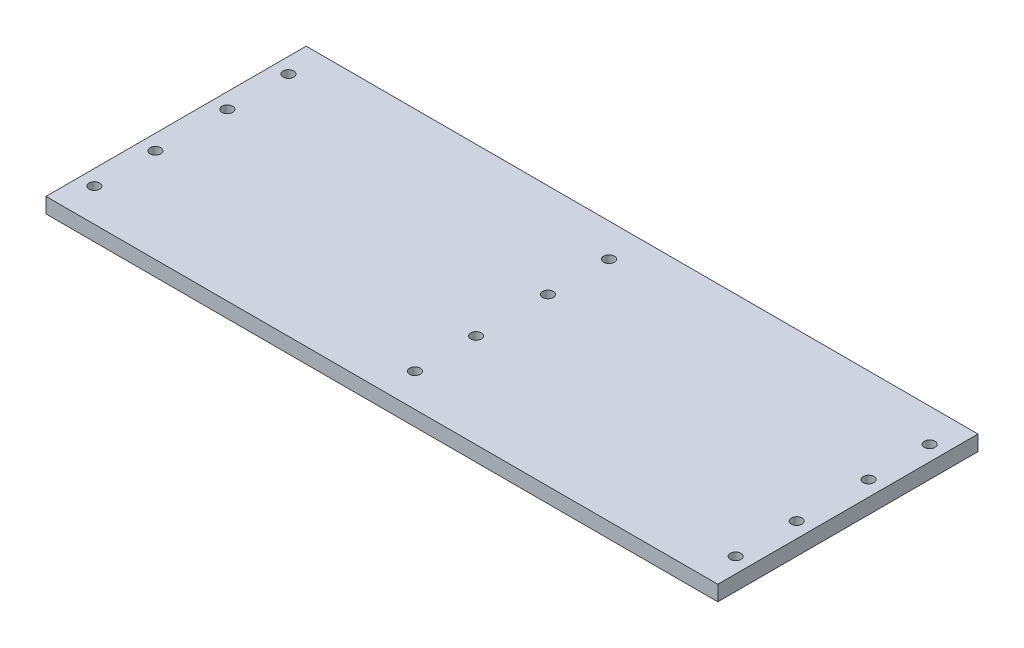
ISO-10303-21;
HEADER;
FILE_DESCRIPTION(('STEP AP214'),'2;1');
FILE_NAME('part.step','',(''),(''),'','','');
FILE_SCHEMA(('AUTOMOTIVE_DESIGN { 1 0 10303 214 1 1 1 1 }'));
ENDSEC;
DATA;
#1=APPLICATION_CONTEXT('core data for automotive mechanical design processes');
#2=APPLICATION_PROTOCOL_DEFINITION('international standard','automotive_design',2000,#1);
#3=PRODUCT_CONTEXT('',#1,'mechanical');
#4=PRODUCT('Part','Part','',(#3));
#5=PRODUCT_RELATED_PRODUCT_CATEGORY('part','',(#4));
#6=PRODUCT_DEFINITION_FORMATION('','',#4);
#7=PRODUCT_DEFINITION_CONTEXT('part definition',#1,'design');
#8=PRODUCT_DEFINITION('design','',#6,#7);
#9=PRODUCT_DEFINITION_SHAPE('','',#8);
#10=(LENGTH_UNIT() NAMED_UNIT(*) SI_UNIT(.MILLI.,.METRE.));
#11=(NAMED_UNIT(*) PLANE_ANGLE_UNIT() SI_UNIT($,.RADIAN.));
#12=(NAMED_UNIT(*) SI_UNIT($,.STERADIAN.) SOLID_ANGLE_UNIT());
#13=UNCERTAINTY_MEASURE_WITH_UNIT(LENGTH_MEASURE(1.E-05),#10,'distance_accuracy_value','');
#14=(GEOMETRIC_REPRESENTATION_CONTEXT(3) GLOBAL_UNCERTAINTY_ASSIGNED_CONTEXT((#13)) GLOBAL_UNIT_ASSIGNED_CONTEXT((#10,
#11,#12)) REPRESENTATION_CONTEXT('',''));
#15=CARTESIAN_POINT('',(0.,0.,0.));
#16=DIRECTION('',(0.,0.,1.));
#17=DIRECTION('',(1.,0.,0.));
#18=AXIS2_PLACEMENT_3D('',#15,#16,#17);
#19=CARTESIAN_POINT('',(0.,5.,0.));
#20=DIRECTION('',(0.,1.,0.));
#21=DIRECTION('',(0.,0.,1.));
#22=AXIS2_PLACEMENT_3D('',#19,#20,#21);
#23=PLANE('',#22);
#24=CARTESIAN_POINT('',(149.295012832051,5.,-13.4872525947132));
#25=DIRECTION('',(0.,1.,0.));
#26=DIRECTION('',(0.,0.,1.));
#27=AXIS2_PLACEMENT_3D('',#24,#25,#26);
#28=CIRCLE('',#27,1.74999999999922);
#29=CARTESIAN_POINT('',(149.295012832051,5.,-11.737252594714));
#30=VERTEX_POINT('',#29);
#31=EDGE_CURVE('E353',#30,#30,#28,.F.);
#32=ORIENTED_EDGE('',*,*,#31,.T.);
#33=EDGE_LOOP('',(#32));
#34=FACE_BOUND('',#33,.T.);
#35=CARTESIAN_POINT('',(-60.704987167949,5.,-33.4872525947146));
#36=DIRECTION('',(0.,1.,0.));
#37=DIRECTION('',(0.,0.,1.));
#38=AXIS2_PLACEMENT_3D('',#35,#36,#37);
#39=CIRCLE('',#38,1.74999999999922);
#40=CARTESIAN_POINT('',(-60.704987167949,5.,-31.7372525947154));
#41=VERTEX_POINT('',#40);
#42=EDGE_CURVE('E364',#41,#41,#39,.F.);
#43=ORIENTED_EDGE('',*,*,#42,.T.);
#44=EDGE_LOOP('',(#43));
#45=FACE_BOUND('',#44,.T.);
#46=CARTESIAN_POINT('',(149.295012832051,5.,10.0527474052838));
#47=DIRECTION('',(0.,1.,0.));
#48=DIRECTION('',(0.,0.,1.));
#49=AXIS2_PLACEMENT_3D('',#46,#47,#48);
#50=CIRCLE('',#49,1.75000000000001);
#51=CARTESIAN_POINT('',(149.295012832051,5.,11.8027474052838));
#52=VERTEX_POINT('',#51);
#53=EDGE_CURVE('E371',#52,#52,#50,.T.);
#54=ORIENTED_EDGE('',*,*,#53,.F.);
#55=EDGE_LOOP('',(#54));
#56=FACE_BOUND('',#55,.T.);
#57=CARTESIAN_POINT('',(44.295012832051,5.,10.0527474052845));
#58=DIRECTION('',(0.,1.,0.));
#59=DIRECTION('',(0.,0.,1.));
#60=AXIS2_PLACEMENT_3D('',#57,#58,#59);
#61=CIRCLE('',#60,1.75000000000001);
#62=CARTESIAN_POINT('',(44.295012832051,5.,11.8027474052845));
#63=VERTEX_POINT('',#62);
#64=EDGE_CURVE('E369',#63,#63,#61,.T.);
#65=ORIENTED_EDGE('',*,*,#64,.F.);
#66=EDGE_LOOP('',(#65));
#67=FACE_BOUND('',#66,.T.);
#68=CARTESIAN_POINT('',(44.2950128320511,5.,30.0527474052845));
#69=DIRECTION('',(0.,1.,0.));
#70=DIRECTION('',(0.,0.,1.));
#71=AXIS2_PLACEMENT_3D('',#68,#69,#70);
#72=CIRCLE('',#71,1.75000000000001);
#73=CARTESIAN_POINT('',(44.2950128320511,5.,31.8027474052845));
#74=VERTEX_POINT('',#73);
#75=EDGE_CURVE('E358',#74,#74,#72,.T.);
#76=ORIENTED_EDGE('',*,*,#75,.F.);
#77=EDGE_LOOP('',(#76));
#78=FACE_BOUND('',#77,.T.);
#79=CARTESIAN_POINT('',(-60.7049871679491,5.,-13.4872525947146));
#80=DIRECTION('',(0.,1.,0.));
#81=DIRECTION('',(0.,0.,1.));
#82=AXIS2_PLACEMENT_3D('',#79,#80,#81);
#83=CIRCLE('',#82,1.74999999999922);
#84=CARTESIAN_POINT('',(-60.7049871679491,5.,-11.7372525947154));
#85=VERTEX_POINT('',#84);
#86=EDGE_CURVE('E410',#85,#85,#83,.F.);
#87=ORIENTED_EDGE('',*,*,#86,.T.);
#88=EDGE_LOOP('',(#87));
#89=FACE_BOUND('',#88,.T.);
#90=CARTESIAN_POINT('',(-60.7049871679489,5.,10.0527474052852));
#91=DIRECTION('',(0.,1.,0.));
#92=DIRECTION('',(0.,0.,1.));
#93=AXIS2_PLACEMENT_3D('',#90,#91,#92);
#94=CIRCLE('',#93,1.75000000000001);
#95=CARTESIAN_POINT('',(-60.7049871679489,5.,11.8027474052852));
#96=VERTEX_POINT('',#95);
#97=EDGE_CURVE('E414',#96,#96,#94,.T.);
#98=ORIENTED_EDGE('',*,*,#97,.F.);
#99=EDGE_LOOP('',(#98));
#100=FACE_BOUND('',#99,.T.);
#101=CARTESIAN_POINT('',(-60.7049871679489,5.,30.0527474052852));
#102=DIRECTION('',(0.,1.,0.));
#103=DIRECTION('',(0.,0.,1.));
#104=AXIS2_PLACEMENT_3D('',#101,#102,#103);
#105=CIRCLE('',#104,1.75000000000001);
#106=CARTESIAN_POINT('',(-60.7049871679489,5.,31.8027474052852));
#107=VERTEX_POINT('',#106);
#108=EDGE_CURVE('E417',#107,#107,#105,.T.);
#109=ORIENTED_EDGE('',*,*,#108,.F.);
#110=EDGE_LOOP('',(#109));
#111=FACE_BOUND('',#110,.T.);
#112=CARTESIAN_POINT('',(149.295012832051,5.,30.0527474052838));
#113=DIRECTION('',(0.,1.,0.));
#114=DIRECTION('',(0.,0.,1.));
#115=AXIS2_PLACEMENT_3D('',#112,#113,#114);
#116=CIRCLE('',#115,1.75000000000001);
#117=CARTESIAN_POINT('',(149.295012832051,5.,31.8027474052838));
#118=VERTEX_POINT('',#117);
#119=EDGE_CURVE('E130',#118,#118,#116,.T.);
#120=ORIENTED_EDGE('',*,*,#119,.F.);
#121=EDGE_LOOP('',(#120));
#122=FACE_BOUND('',#121,.T.);
#123=DIRECTION('',(0.,0.,1.));
#124=VECTOR('',#123,1.);
#125=CARTESIAN_POINT('',(-65.7049871679489,5.,-44.3172525947162));
#126=LINE('',#125,#124);
#127=CARTESIAN_POINT('',(-65.7049871679489,5.,-44.3172525947162));
#128=VERTEX_POINT('',#127);
#129=CARTESIAN_POINT('',(-65.7049871679489,5.,40.8827474052838));
#130=VERTEX_POINT('',#129);
#131=EDGE_CURVE('E94',#128,#130,#126,.T.);
#132=ORIENTED_EDGE('',*,*,#131,.T.);
#133=DIRECTION('',(1.,0.,0.));
#134=VECTOR('',#133,1.);
#135=CARTESIAN_POINT('',(-65.7049871679489,5.,40.8827474052838));
#136=LINE('',#135,#134);
#137=CARTESIAN_POINT('',(154.295012832051,5.,40.8827474052838));
#138=VERTEX_POINT('',#137);
#139=EDGE_CURVE('E89',#130,#138,#136,.T.);
#140=ORIENTED_EDGE('',*,*,#139,.T.);
#141=DIRECTION('',(0.,0.,-1.));
#142=VECTOR('',#141,1.);
#143=CARTESIAN_POINT('',(154.295012832051,5.,-44.3172525947162));
#144=LINE('',#143,#142);
#145=CARTESIAN_POINT('',(154.295012832051,5.,-44.3172525947162));
#146=VERTEX_POINT('',#145);
#147=EDGE_CURVE('E92',#138,#146,#144,.T.);
#148=ORIENTED_EDGE('',*,*,#147,.T.);
#149=DIRECTION('',(-1.,0.,0.));
#150=VECTOR('',#149,1.);
#151=CARTESIAN_POINT('',(-65.7049871679489,5.,-44.3172525947162));
#152=LINE('',#151,#150);
#153=EDGE_CURVE('E59',#146,#128,#152,.T.);
#154=ORIENTED_EDGE('',*,*,#153,.T.);
#155=EDGE_LOOP('',(#132,#140,#148,#154));
#156=FACE_BOUND('',#155,.T.);
#157=CARTESIAN_POINT('',(44.2950128320509,5.,-13.4872525947139));
#158=DIRECTION('',(0.,1.,0.));
#159=DIRECTION('',(0.,0.,1.));
#160=AXIS2_PLACEMENT_3D('',#157,#158,#159);
#161=CIRCLE('',#160,1.74999999999922);
#162=CARTESIAN_POINT('',(44.2950128320509,5.,-11.7372525947147));
#163=VERTEX_POINT('',#162);
#164=EDGE_CURVE('E352',#163,#163,#161,.F.);
#165=ORIENTED_EDGE('',*,*,#164,.T.);
#166=EDGE_LOOP('',(#165));
#167=FACE_BOUND('',#166,.T.);
#168=CARTESIAN_POINT('',(149.295012832051,5.,-33.4872525947132));
#169=DIRECTION('',(0.,1.,0.));
#170=DIRECTION('',(0.,0.,1.));
#171=AXIS2_PLACEMENT_3D('',#168,#169,#170);
#172=CIRCLE('',#171,1.74999999999922);
#173=CARTESIAN_POINT('',(149.295012832051,5.,-31.737252594714));
#174=VERTEX_POINT('',#173);
#175=EDGE_CURVE('E361',#174,#174,#172,.F.);
#176=ORIENTED_EDGE('',*,*,#175,.T.);
#177=EDGE_LOOP('',(#176));
#178=FACE_BOUND('',#177,.T.);
#179=CARTESIAN_POINT('',(44.295012832051,5.,-33.4872525947139));
#180=DIRECTION('',(0.,1.,0.));
#181=DIRECTION('',(0.,0.,1.));
#182=AXIS2_PLACEMENT_3D('',#179,#180,#181);
#183=CIRCLE('',#182,1.74999999999922);
#184=CARTESIAN_POINT('',(44.295012832051,5.,-31.7372525947147));
#185=VERTEX_POINT('',#184);
#186=EDGE_CURVE('E349',#185,#185,#183,.F.);
#187=ORIENTED_EDGE('',*,*,#186,.T.);
#188=EDGE_LOOP('',(#187));
#189=FACE_BOUND('',#188,.T.);
#190=ADVANCED_FACE('F39',(#34,#45,#56,#67,#78,#89,#100,#111,#122,#156,#167,#178,#189),#23,.T.);
#191=CARTESIAN_POINT('',(0.,0.,0.));
#192=DIRECTION('',(0.,1.,0.));
#193=DIRECTION('',(0.,0.,1.));
#194=AXIS2_PLACEMENT_3D('',#191,#192,#193);
#195=PLANE('',#194);
#196=CARTESIAN_POINT('',(149.295012832051,0.,10.0527474052838));
#197=DIRECTION('',(0.,1.,0.));
#198=DIRECTION('',(0.,0.,1.));
#199=AXIS2_PLACEMENT_3D('',#196,#197,#198);
#200=CIRCLE('',#199,1.75000000000001);
#201=CARTESIAN_POINT('',(149.295012832051,0.,11.8027474052838));
#202=VERTEX_POINT('',#201);
#203=EDGE_CURVE('E154',#202,#202,#200,.T.);
#204=ORIENTED_EDGE('',*,*,#203,.T.);
#205=EDGE_LOOP('',(#204));
#206=FACE_BOUND('',#205,.T.);
#207=CARTESIAN_POINT('',(44.295012832051,0.,10.0527474052845));
#208=DIRECTION('',(0.,1.,0.));
#209=DIRECTION('',(0.,0.,1.));
#210=AXIS2_PLACEMENT_3D('',#207,#208,#209);
#211=CIRCLE('',#210,1.75000000000001);
#212=CARTESIAN_POINT('',(44.295012832051,0.,11.8027474052845));
#213=VERTEX_POINT('',#212);
#214=EDGE_CURVE('E150',#213,#213,#211,.T.);
#215=ORIENTED_EDGE('',*,*,#214,.T.);
#216=EDGE_LOOP('',(#215));
#217=FACE_BOUND('',#216,.T.);
#218=CARTESIAN_POINT('',(44.2950128320511,0.,30.0527474052845));
#219=DIRECTION('',(0.,1.,0.));
#220=DIRECTION('',(0.,0.,1.));
#221=AXIS2_PLACEMENT_3D('',#218,#219,#220);
#222=CIRCLE('',#221,1.75000000000001);
#223=CARTESIAN_POINT('',(44.2950128320511,0.,31.8027474052845));
#224=VERTEX_POINT('',#223);
#225=EDGE_CURVE('E146',#224,#224,#222,.T.);
#226=ORIENTED_EDGE('',*,*,#225,.T.);
#227=EDGE_LOOP('',(#226));
#228=FACE_BOUND('',#227,.T.);
#229=CARTESIAN_POINT('',(-60.7049871679489,0.,10.0527474052852));
#230=DIRECTION('',(0.,1.,0.));
#231=DIRECTION('',(0.,0.,1.));
#232=AXIS2_PLACEMENT_3D('',#229,#230,#231);
#233=CIRCLE('',#232,1.75000000000001);
#234=CARTESIAN_POINT('',(-60.7049871679489,0.,11.8027474052852));
#235=VERTEX_POINT('',#234);
#236=EDGE_CURVE('E134',#235,#235,#233,.T.);
#237=ORIENTED_EDGE('',*,*,#236,.T.);
#238=EDGE_LOOP('',(#237));
#239=FACE_BOUND('',#238,.T.);
#240=CARTESIAN_POINT('',(-60.7049871679489,0.,30.0527474052852));
#241=DIRECTION('',(0.,1.,0.));
#242=DIRECTION('',(0.,0.,1.));
#243=AXIS2_PLACEMENT_3D('',#240,#241,#242);
#244=CIRCLE('',#243,1.75000000000001);
#245=CARTESIAN_POINT('',(-60.7049871679489,0.,31.8027474052852));
#246=VERTEX_POINT('',#245);
#247=EDGE_CURVE('E129',#246,#246,#244,.T.);
#248=ORIENTED_EDGE('',*,*,#247,.T.);
#249=EDGE_LOOP('',(#248));
#250=FACE_BOUND('',#249,.T.);
#251=CARTESIAN_POINT('',(149.295012832051,0.,30.0527474052838));
#252=DIRECTION('',(0.,1.,0.));
#253=DIRECTION('',(0.,0.,1.));
#254=AXIS2_PLACEMENT_3D('',#251,#252,#253);
#255=CIRCLE('',#254,1.75000000000001);
#256=CARTESIAN_POINT('',(149.295012832051,0.,31.8027474052838));
#257=VERTEX_POINT('',#256);
#258=EDGE_CURVE('E125',#257,#257,#255,.T.);
#259=ORIENTED_EDGE('',*,*,#258,.T.);
#260=EDGE_LOOP('',(#259));
#261=FACE_BOUND('',#260,.T.);
#262=DIRECTION('',(0.,0.,1.));
#263=VECTOR('',#262,1.);
#264=CARTESIAN_POINT('',(-65.7049871679489,0.,-44.3172525947162));
#265=LINE('',#264,#263);
#266=CARTESIAN_POINT('',(-65.7049871679489,0.,-44.3172525947162));
#267=VERTEX_POINT('',#266);
#268=CARTESIAN_POINT('',(-65.7049871679489,0.,40.8827474052838));
#269=VERTEX_POINT('',#268);
#270=EDGE_CURVE('E111',#267,#269,#265,.T.);
#271=ORIENTED_EDGE('',*,*,#270,.F.);
#272=DIRECTION('',(-1.,0.,0.));
#273=VECTOR('',#272,1.);
#274=CARTESIAN_POINT('',(-65.7049871679489,0.,-44.3172525947162));
#275=LINE('',#274,#273);
#276=CARTESIAN_POINT('',(154.295012832051,0.,-44.3172525947162));
#277=VERTEX_POINT('',#276);
#278=EDGE_CURVE('E82',#277,#267,#275,.T.);
#279=ORIENTED_EDGE('',*,*,#278,.F.);
#280=DIRECTION('',(0.,0.,-1.));
#281=VECTOR('',#280,1.);
#282=CARTESIAN_POINT('',(154.295012832051,0.,-44.3172525947162));
#283=LINE('',#282,#281);
#284=CARTESIAN_POINT('',(154.295012832051,0.,40.8827474052838));
#285=VERTEX_POINT('',#284);
#286=EDGE_CURVE('E76',#285,#277,#283,.T.);
#287=ORIENTED_EDGE('',*,*,#286,.F.);
#288=DIRECTION('',(1.,0.,0.));
#289=VECTOR('',#288,1.);
#290=CARTESIAN_POINT('',(-65.7049871679489,0.,40.8827474052838));
#291=LINE('',#290,#289);
#292=EDGE_CURVE('E99',#269,#285,#291,.T.);
#293=ORIENTED_EDGE('',*,*,#292,.F.);
#294=EDGE_LOOP('',(#271,#279,#287,#293));
#295=FACE_BOUND('',#294,.T.);
#296=CARTESIAN_POINT('',(-60.7049871679491,0.,-13.4872525947146));
#297=DIRECTION('',(0.,1.,0.));
#298=DIRECTION('',(0.,0.,1.));
#299=AXIS2_PLACEMENT_3D('',#296,#297,#298);
#300=CIRCLE('',#299,1.74999999999922);
#301=CARTESIAN_POINT('',(-60.7049871679491,0.,-11.7372525947154));
#302=VERTEX_POINT('',#301);
#303=EDGE_CURVE('E138',#302,#302,#300,.F.);
#304=ORIENTED_EDGE('',*,*,#303,.F.);
#305=EDGE_LOOP('',(#304));
#306=FACE_BOUND('',#305,.T.);
#307=CARTESIAN_POINT('',(44.2950128320509,0.,-13.4872525947139));
#308=DIRECTION('',(0.,1.,0.));
#309=DIRECTION('',(0.,0.,1.));
#310=AXIS2_PLACEMENT_3D('',#307,#308,#309);
#311=CIRCLE('',#310,1.74999999999922);
#312=CARTESIAN_POINT('',(44.2950128320509,0.,-11.7372525947147));
#313=VERTEX_POINT('',#312);
#314=EDGE_CURVE('E142',#313,#313,#311,.F.);
#315=ORIENTED_EDGE('',*,*,#314,.F.);
#316=EDGE_LOOP('',(#315));
#317=FACE_BOUND('',#316,.T.);
#318=CARTESIAN_POINT('',(-60.704987167949,0.,-33.4872525947146));
#319=DIRECTION('',(0.,1.,0.));
#320=DIRECTION('',(0.,0.,1.));
#321=AXIS2_PLACEMENT_3D('',#318,#319,#320);
#322=CIRCLE('',#321,1.74999999999922);
#323=CARTESIAN_POINT('',(-60.704987167949,0.,-31.7372525947154));
#324=VERTEX_POINT('',#323);
#325=EDGE_CURVE('E158',#324,#324,#322,.F.);
#326=ORIENTED_EDGE('',*,*,#325,.F.);
#327=EDGE_LOOP('',(#326));
#328=FACE_BOUND('',#327,.T.);
#329=CARTESIAN_POINT('',(149.295012832051,0.,-33.4872525947132));
#330=DIRECTION('',(0.,1.,0.));
#331=DIRECTION('',(0.,0.,1.));
#332=AXIS2_PLACEMENT_3D('',#329,#330,#331);
#333=CIRCLE('',#332,1.74999999999922);
#334=CARTESIAN_POINT('',(149.295012832051,0.,-31.737252594714));
#335=VERTEX_POINT('',#334);
#336=EDGE_CURVE('E162',#335,#335,#333,.F.);
#337=ORIENTED_EDGE('',*,*,#336,.F.);
#338=EDGE_LOOP('',(#337));
#339=FACE_BOUND('',#338,.T.);
#340=CARTESIAN_POINT('',(149.295012832051,0.,-13.4872525947132));
#341=DIRECTION('',(0.,1.,0.));
#342=DIRECTION('',(0.,0.,1.));
#343=AXIS2_PLACEMENT_3D('',#340,#341,#342);
#344=CIRCLE('',#343,1.74999999999922);
#345=CARTESIAN_POINT('',(149.295012832051,0.,-11.737252594714));
#346=VERTEX_POINT('',#345);
#347=EDGE_CURVE('E165',#346,#346,#344,.F.);
#348=ORIENTED_EDGE('',*,*,#347,.F.);
#349=EDGE_LOOP('',(#348));
#350=FACE_BOUND('',#349,.T.);
#351=CARTESIAN_POINT('',(44.295012832051,0.,-33.4872525947139));
#352=DIRECTION('',(0.,1.,0.));
#353=DIRECTION('',(0.,0.,1.));
#354=AXIS2_PLACEMENT_3D('',#351,#352,#353);
#355=CIRCLE('',#354,1.74999999999922);
#356=CARTESIAN_POINT('',(44.295012832051,0.,-31.7372525947147));
#357=VERTEX_POINT('',#356);
#358=EDGE_CURVE('E43',#357,#357,#355,.F.);
#359=ORIENTED_EDGE('',*,*,#358,.F.);
#360=EDGE_LOOP('',(#359));
#361=FACE_BOUND('',#360,.T.);
#362=ADVANCED_FACE('F176',(#206,#217,#228,#239,#250,#261,#295,#306,#317,#328,#339,#350,#361),
#195,.F.);
#363=CARTESIAN_POINT('',(-65.7049871679489,5.,-44.3172525947162));
#364=DIRECTION('',(1.,0.,0.));
#365=DIRECTION('',(0.,0.,-1.));
#366=AXIS2_PLACEMENT_3D('',#363,#364,#365);
#367=PLANE('',#366);
#368=ORIENTED_EDGE('',*,*,#270,.T.);
#369=DIRECTION('',(0.,-1.,0.));
#370=VECTOR('',#369,1.);
#371=CARTESIAN_POINT('',(-65.7049871679489,5.,40.8827474052838));
#372=LINE('',#371,#370);
#373=EDGE_CURVE('E11',#130,#269,#372,.T.);
#374=ORIENTED_EDGE('',*,*,#373,.F.);
#375=ORIENTED_EDGE('',*,*,#131,.F.);
#376=DIRECTION('',(0.,-1.,0.));
#377=VECTOR('',#376,1.);
#378=CARTESIAN_POINT('',(-65.7049871679489,5.,-44.3172525947162));
#379=LINE('',#378,#377);
#380=EDGE_CURVE('E107',#128,#267,#379,.T.);
#381=ORIENTED_EDGE('',*,*,#380,.T.);
#382=EDGE_LOOP('',(#368,#374,#375,#381));
#383=FACE_BOUND('',#382,.T.);
#384=ADVANCED_FACE('F41',(#383),#367,.F.);
#385=CARTESIAN_POINT('',(-65.7049871679489,5.,40.8827474052838));
#386=DIRECTION('',(0.,0.,-1.));
#387=DIRECTION('',(-1.,0.,0.));
#388=AXIS2_PLACEMENT_3D('',#385,#386,#387);
#389=PLANE('',#388);
#390=ORIENTED_EDGE('',*,*,#292,.T.);
#391=DIRECTION('',(0.,-1.,0.));
#392=VECTOR('',#391,1.);
#393=CARTESIAN_POINT('',(154.295012832051,5.,40.8827474052838));
#394=LINE('',#393,#392);
#395=EDGE_CURVE('E50',#138,#285,#394,.T.);
#396=ORIENTED_EDGE('',*,*,#395,.F.);
#397=ORIENTED_EDGE('',*,*,#139,.F.);
#398=ORIENTED_EDGE('',*,*,#373,.T.);
#399=EDGE_LOOP('',(#390,#396,#397,#398));
#400=FACE_BOUND('',#399,.T.);
#401=ADVANCED_FACE('F98',(#400),#389,.F.);
#402=CARTESIAN_POINT('',(154.295012832051,5.,-44.3172525947162));
#403=DIRECTION('',(-1.,0.,0.));
#404=DIRECTION('',(0.,0.,1.));
#405=AXIS2_PLACEMENT_3D('',#402,#403,#404);
#406=PLANE('',#405);
#407=ORIENTED_EDGE('',*,*,#286,.T.);
#408=DIRECTION('',(0.,-1.,0.));
#409=VECTOR('',#408,1.);
#410=CARTESIAN_POINT('',(154.295012832051,5.,-44.3172525947162));
#411=LINE('',#410,#409);
#412=EDGE_CURVE('E101',#146,#277,#411,.T.);
#413=ORIENTED_EDGE('',*,*,#412,.F.);
#414=ORIENTED_EDGE('',*,*,#147,.F.);
#415=ORIENTED_EDGE('',*,*,#395,.T.);
#416=EDGE_LOOP('',(#407,#413,#414,#415));
#417=FACE_BOUND('',#416,.T.);
#418=ADVANCED_FACE('F103',(#417),#406,.F.);
#419=CARTESIAN_POINT('',(-65.7049871679489,5.,-44.3172525947162));
#420=DIRECTION('',(0.,0.,1.));
#421=DIRECTION('',(1.,0.,0.));
#422=AXIS2_PLACEMENT_3D('',#419,#420,#421);
#423=PLANE('',#422);
#424=ORIENTED_EDGE('',*,*,#278,.T.);
#425=ORIENTED_EDGE('',*,*,#380,.F.);
#426=ORIENTED_EDGE('',*,*,#153,.F.);
#427=ORIENTED_EDGE('',*,*,#412,.T.);
#428=EDGE_LOOP('',(#424,#425,#426,#427));
#429=FACE_BOUND('',#428,.T.);
#430=ADVANCED_FACE('F190',(#429),#423,.F.);
#431=CARTESIAN_POINT('',(149.295012832051,-5.,30.0527474052838));
#432=DIRECTION('',(0.,1.,0.));
#433=DIRECTION('',(0.,0.,1.));
#434=AXIS2_PLACEMENT_3D('',#431,#432,#433);
#435=CYLINDRICAL_SURFACE('',#434,1.75000000000001);
#436=ORIENTED_EDGE('',*,*,#119,.T.);
#437=EDGE_LOOP('',(#436));
#438=FACE_BOUND('',#437,.T.);
#439=ORIENTED_EDGE('',*,*,#258,.F.);
#440=EDGE_LOOP('',(#439));
#441=FACE_BOUND('',#440,.T.);
#442=ADVANCED_FACE('F193',(#438,#441),#435,.F.);
#443=CARTESIAN_POINT('',(-60.7049871679489,-5.,30.0527474052852));
#444=DIRECTION('',(0.,1.,0.));
#445=DIRECTION('',(0.,0.,1.));
#446=AXIS2_PLACEMENT_3D('',#443,#444,#445);
#447=CYLINDRICAL_SURFACE('',#446,1.75000000000001);
#448=ORIENTED_EDGE('',*,*,#108,.T.);
#449=EDGE_LOOP('',(#448));
#450=FACE_BOUND('',#449,.T.);
#451=ORIENTED_EDGE('',*,*,#247,.F.);
#452=EDGE_LOOP('',(#451));
#453=FACE_BOUND('',#452,.T.);
#454=ADVANCED_FACE('F215',(#450,#453),#447,.F.);
#455=CARTESIAN_POINT('',(-60.7049871679489,-5.,10.0527474052852));
#456=DIRECTION('',(0.,1.,0.));
#457=DIRECTION('',(0.,0.,1.));
#458=AXIS2_PLACEMENT_3D('',#455,#456,#457);
#459=CYLINDRICAL_SURFACE('',#458,1.75000000000001);
#460=ORIENTED_EDGE('',*,*,#97,.T.);
#461=EDGE_LOOP('',(#460));
#462=FACE_BOUND('',#461,.T.);
#463=ORIENTED_EDGE('',*,*,#236,.F.);
#464=EDGE_LOOP('',(#463));
#465=FACE_BOUND('',#464,.T.);
#466=ADVANCED_FACE('F222',(#462,#465),#459,.F.);
#467=CARTESIAN_POINT('',(-60.7049871679491,-5.,-13.4872525947146));
#468=DIRECTION('',(0.,1.,0.));
#469=DIRECTION('',(0.,0.,1.));
#470=AXIS2_PLACEMENT_3D('',#467,#468,#469);
#471=CYLINDRICAL_SURFACE('',#470,1.74999999999922);
#472=ORIENTED_EDGE('',*,*,#86,.F.);
#473=EDGE_LOOP('',(#472));
#474=FACE_BOUND('',#473,.T.);
#475=ORIENTED_EDGE('',*,*,#303,.T.);
#476=EDGE_LOOP('',(#475));
#477=FACE_BOUND('',#476,.T.);
#478=ADVANCED_FACE('F230',(#474,#477),#471,.F.);
#479=CARTESIAN_POINT('',(44.2950128320509,-5.,-13.4872525947139));
#480=DIRECTION('',(0.,1.,0.));
#481=DIRECTION('',(0.,0.,1.));
#482=AXIS2_PLACEMENT_3D('',#479,#480,#481);
#483=CYLINDRICAL_SURFACE('',#482,1.74999999999922);
#484=ORIENTED_EDGE('',*,*,#164,.F.);
#485=EDGE_LOOP('',(#484));
#486=FACE_BOUND('',#485,.T.);
#487=ORIENTED_EDGE('',*,*,#314,.T.);
#488=EDGE_LOOP('',(#487));
#489=FACE_BOUND('',#488,.T.);
#490=ADVANCED_FACE('F238',(#486,#489),#483,.F.);
#491=CARTESIAN_POINT('',(44.2950128320511,-5.,30.0527474052845));
#492=DIRECTION('',(0.,1.,0.));
#493=DIRECTION('',(0.,0.,1.));
#494=AXIS2_PLACEMENT_3D('',#491,#492,#493);
#495=CYLINDRICAL_SURFACE('',#494,1.75000000000001);
#496=ORIENTED_EDGE('',*,*,#75,.T.);
#497=EDGE_LOOP('',(#496));
#498=FACE_BOUND('',#497,.T.);
#499=ORIENTED_EDGE('',*,*,#225,.F.);
#500=EDGE_LOOP('',(#499));
#501=FACE_BOUND('',#500,.T.);
#502=ADVANCED_FACE('F246',(#498,#501),#495,.F.);
#503=CARTESIAN_POINT('',(44.295012832051,-5.,10.0527474052845));
#504=DIRECTION('',(0.,1.,0.));
#505=DIRECTION('',(0.,0.,1.));
#506=AXIS2_PLACEMENT_3D('',#503,#504,#505);
#507=CYLINDRICAL_SURFACE('',#506,1.75000000000001);
#508=ORIENTED_EDGE('',*,*,#64,.T.);
#509=EDGE_LOOP('',(#508));
#510=FACE_BOUND('',#509,.T.);
#511=ORIENTED_EDGE('',*,*,#214,.F.);
#512=EDGE_LOOP('',(#511));
#513=FACE_BOUND('',#512,.T.);
#514=ADVANCED_FACE('F254',(#510,#513),#507,.F.);
#515=CARTESIAN_POINT('',(149.295012832051,-5.,10.0527474052838));
#516=DIRECTION('',(0.,1.,0.));
#517=DIRECTION('',(0.,0.,1.));
#518=AXIS2_PLACEMENT_3D('',#515,#516,#517);
#519=CYLINDRICAL_SURFACE('',#518,1.75000000000001);
#520=ORIENTED_EDGE('',*,*,#53,.T.);
#521=EDGE_LOOP('',(#520));
#522=FACE_BOUND('',#521,.T.);
#523=ORIENTED_EDGE('',*,*,#203,.F.);
#524=EDGE_LOOP('',(#523));
#525=FACE_BOUND('',#524,.T.);
#526=ADVANCED_FACE('F262',(#522,#525),#519,.F.);
#527=CARTESIAN_POINT('',(-60.704987167949,-5.,-33.4872525947146));
#528=DIRECTION('',(0.,1.,0.));
#529=DIRECTION('',(0.,0.,1.));
#530=AXIS2_PLACEMENT_3D('',#527,#528,#529);
#531=CYLINDRICAL_SURFACE('',#530,1.74999999999922);
#532=ORIENTED_EDGE('',*,*,#42,.F.);
#533=EDGE_LOOP('',(#532));
#534=FACE_BOUND('',#533,.T.);
#535=ORIENTED_EDGE('',*,*,#325,.T.);
#536=EDGE_LOOP('',(#535));
#537=FACE_BOUND('',#536,.T.);
#538=ADVANCED_FACE('F270',(#534,#537),#531,.F.);
#539=CARTESIAN_POINT('',(149.295012832051,-5.,-33.4872525947132));
#540=DIRECTION('',(0.,1.,0.));
#541=DIRECTION('',(0.,0.,1.));
#542=AXIS2_PLACEMENT_3D('',#539,#540,#541);
#543=CYLINDRICAL_SURFACE('',#542,1.74999999999922);
#544=ORIENTED_EDGE('',*,*,#175,.F.);
#545=EDGE_LOOP('',(#544));
#546=FACE_BOUND('',#545,.T.);
#547=ORIENTED_EDGE('',*,*,#336,.T.);
#548=EDGE_LOOP('',(#547));
#549=FACE_BOUND('',#548,.T.);
#550=ADVANCED_FACE('F278',(#546,#549),#543,.F.);
#551=CARTESIAN_POINT('',(149.295012832051,-5.,-13.4872525947132));
#552=DIRECTION('',(0.,1.,0.));
#553=DIRECTION('',(0.,0.,1.));
#554=AXIS2_PLACEMENT_3D('',#551,#552,#553);
#555=CYLINDRICAL_SURFACE('',#554,1.74999999999922);
#556=ORIENTED_EDGE('',*,*,#31,.F.);
#557=EDGE_LOOP('',(#556));
#558=FACE_BOUND('',#557,.T.);
#559=ORIENTED_EDGE('',*,*,#347,.T.);
#560=EDGE_LOOP('',(#559));
#561=FACE_BOUND('',#560,.T.);
#562=ADVANCED_FACE('F286',(#558,#561),#555,.F.);
#563=CARTESIAN_POINT('',(44.295012832051,-5.,-33.4872525947139));
#564=DIRECTION('',(0.,1.,0.));
#565=DIRECTION('',(0.,0.,1.));
#566=AXIS2_PLACEMENT_3D('',#563,#564,#565);
#567=CYLINDRICAL_SURFACE('',#566,1.74999999999922);
#568=ORIENTED_EDGE('',*,*,#186,.F.);
#569=EDGE_LOOP('',(#568));
#570=FACE_BOUND('',#569,.T.);
#571=ORIENTED_EDGE('',*,*,#358,.T.);
#572=EDGE_LOOP('',(#571));
#573=FACE_BOUND('',#572,.T.);
#574=ADVANCED_FACE('F174',(#570,#573),#567,.F.);
#575=CLOSED_SHELL('',(#190,#362,#384,#401,#418,#430,#442,#454,#466,#478,#490,#502,#514,#526,
#538,#550,#562,#574));
#576=MANIFOLD_SOLID_BREP('B2',#575);
#577=ADVANCED_BREP_SHAPE_REPRESENTATION('',(#18,#576),#14);
#578=SHAPE_DEFINITION_REPRESENTATION(#9,#577);
ENDSEC;
END-ISO-10303-21;
